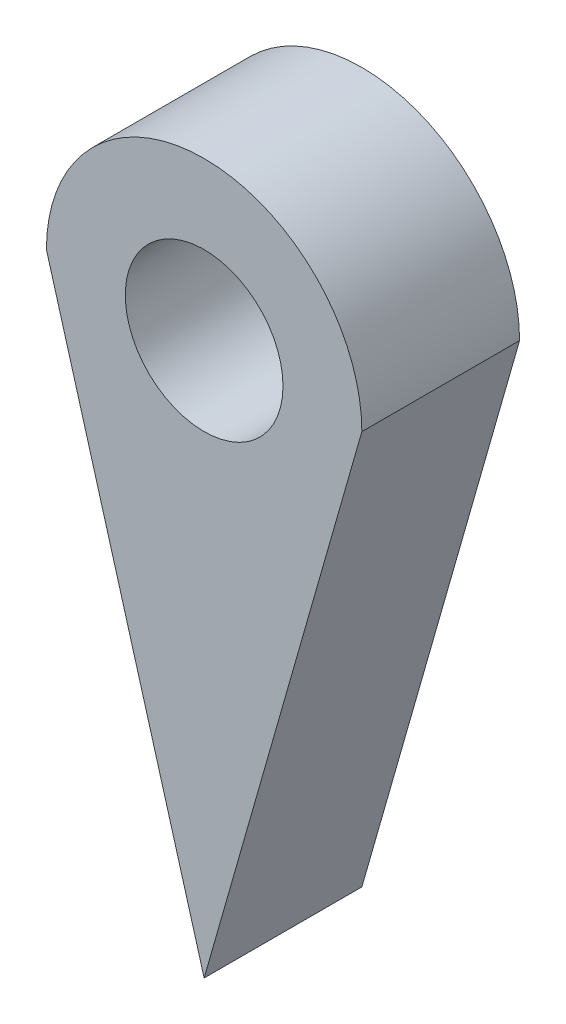
ISO-10303-21;
HEADER;
FILE_DESCRIPTION(('STEP AP214'),'2;1');
FILE_NAME('part.step','',(''),(''),'','','');
FILE_SCHEMA(('AUTOMOTIVE_DESIGN { 1 0 10303 214 1 1 1 1 }'));
ENDSEC;
DATA;
#1=APPLICATION_CONTEXT('core data for automotive mechanical design processes');
#2=APPLICATION_PROTOCOL_DEFINITION('international standard','automotive_design',2000,#1);
#3=PRODUCT_CONTEXT('',#1,'mechanical');
#4=PRODUCT('Part','Part','',(#3));
#5=PRODUCT_RELATED_PRODUCT_CATEGORY('part','',(#4));
#6=PRODUCT_DEFINITION_FORMATION('','',#4);
#7=PRODUCT_DEFINITION_CONTEXT('part definition',#1,'design');
#8=PRODUCT_DEFINITION('design','',#6,#7);
#9=PRODUCT_DEFINITION_SHAPE('','',#8);
#10=(LENGTH_UNIT() NAMED_UNIT(*) SI_UNIT(.MILLI.,.METRE.));
#11=(NAMED_UNIT(*) PLANE_ANGLE_UNIT() SI_UNIT($,.RADIAN.));
#12=(NAMED_UNIT(*) SI_UNIT($,.STERADIAN.) SOLID_ANGLE_UNIT());
#13=UNCERTAINTY_MEASURE_WITH_UNIT(LENGTH_MEASURE(1.E-05),#10,'distance_accuracy_value','');
#14=(GEOMETRIC_REPRESENTATION_CONTEXT(3) GLOBAL_UNCERTAINTY_ASSIGNED_CONTEXT((#13)) GLOBAL_UNIT_ASSIGNED_CONTEXT((#10,
#11,#12)) REPRESENTATION_CONTEXT('',''));
#15=CARTESIAN_POINT('',(0.,0.,0.));
#16=DIRECTION('',(0.,0.,1.));
#17=DIRECTION('',(1.,0.,0.));
#18=AXIS2_PLACEMENT_3D('',#15,#16,#17);
#19=CARTESIAN_POINT('',(0.,0.,4.));
#20=DIRECTION('',(0.,0.,-1.));
#21=DIRECTION('',(-1.,0.,0.));
#22=AXIS2_PLACEMENT_3D('',#19,#20,#21);
#23=CYLINDRICAL_SURFACE('',#22,4.);
#24=CARTESIAN_POINT('',(0.,0.,0.));
#25=DIRECTION('',(0.,0.,1.));
#26=DIRECTION('',(1.,0.,0.));
#27=AXIS2_PLACEMENT_3D('',#24,#25,#26);
#28=CIRCLE('',#27,4.);
#29=CARTESIAN_POINT('',(4.,0.,0.));
#30=VERTEX_POINT('',#29);
#31=CARTESIAN_POINT('',(-4.,0.,0.));
#32=VERTEX_POINT('',#31);
#33=EDGE_CURVE('E84',#30,#32,#28,.T.);
#34=ORIENTED_EDGE('',*,*,#33,.T.);
#35=DIRECTION('',(0.,0.,-1.));
#36=VECTOR('',#35,1.);
#37=CARTESIAN_POINT('',(-4.,0.,4.));
#38=LINE('',#37,#36);
#39=CARTESIAN_POINT('',(-4.,0.,4.));
#40=VERTEX_POINT('',#39);
#41=EDGE_CURVE('E11',#40,#32,#38,.T.);
#42=ORIENTED_EDGE('',*,*,#41,.F.);
#43=CARTESIAN_POINT('',(0.,0.,4.));
#44=DIRECTION('',(0.,0.,1.));
#45=DIRECTION('',(1.,0.,0.));
#46=AXIS2_PLACEMENT_3D('',#43,#44,#45);
#47=CIRCLE('',#46,4.);
#48=CARTESIAN_POINT('',(4.,0.,4.));
#49=VERTEX_POINT('',#48);
#50=EDGE_CURVE('E75',#49,#40,#47,.T.);
#51=ORIENTED_EDGE('',*,*,#50,.F.);
#52=DIRECTION('',(0.,0.,-1.));
#53=VECTOR('',#52,1.);
#54=CARTESIAN_POINT('',(4.,0.,4.));
#55=LINE('',#54,#53);
#56=EDGE_CURVE('E85',#49,#30,#55,.T.);
#57=ORIENTED_EDGE('',*,*,#56,.T.);
#58=EDGE_LOOP('',(#34,#42,#51,#57));
#59=FACE_BOUND('',#58,.T.);
#60=ADVANCED_FACE('F35',(#59),#23,.T.);
#61=CARTESIAN_POINT('',(-3.69811320754717,-1.05660377358491,4.));
#62=DIRECTION('',(0.961523947640823,0.274721127897378,0.));
#63=DIRECTION('',(-0.274721127897378,0.961523947640823,0.));
#64=AXIS2_PLACEMENT_3D('',#61,#62,#63);
#65=PLANE('',#64);
#66=DIRECTION('',(0.274721127897378,-0.961523947640823,0.));
#67=VECTOR('',#66,1.);
#68=CARTESIAN_POINT('',(-3.69811320754717,-1.05660377358491,0.));
#69=LINE('',#68,#67);
#70=CARTESIAN_POINT('',(0.,-14.,0.));
#71=VERTEX_POINT('',#70);
#72=EDGE_CURVE('E63',#32,#71,#69,.T.);
#73=ORIENTED_EDGE('',*,*,#72,.T.);
#74=DIRECTION('',(0.,0.,-1.));
#75=VECTOR('',#74,1.);
#76=CARTESIAN_POINT('',(0.,-14.,4.));
#77=LINE('',#76,#75);
#78=CARTESIAN_POINT('',(0.,-14.,4.));
#79=VERTEX_POINT('',#78);
#80=EDGE_CURVE('E43',#79,#71,#77,.T.);
#81=ORIENTED_EDGE('',*,*,#80,.F.);
#82=DIRECTION('',(0.274721127897378,-0.961523947640823,0.));
#83=VECTOR('',#82,1.);
#84=CARTESIAN_POINT('',(-3.69811320754717,-1.05660377358491,4.));
#85=LINE('',#84,#83);
#86=EDGE_CURVE('E71',#40,#79,#85,.T.);
#87=ORIENTED_EDGE('',*,*,#86,.F.);
#88=ORIENTED_EDGE('',*,*,#41,.T.);
#89=EDGE_LOOP('',(#73,#81,#87,#88));
#90=FACE_BOUND('',#89,.T.);
#91=ADVANCED_FACE('F72',(#90),#65,.F.);
#92=CARTESIAN_POINT('',(3.69811320754717,-1.05660377358491,4.));
#93=DIRECTION('',(-0.961523947640823,0.274721127897378,0.));
#94=DIRECTION('',(-0.274721127897378,-0.961523947640823,0.));
#95=AXIS2_PLACEMENT_3D('',#92,#93,#94);
#96=PLANE('',#95);
#97=DIRECTION('',(0.274721127897378,0.961523947640823,0.));
#98=VECTOR('',#97,1.);
#99=CARTESIAN_POINT('',(3.69811320754717,-1.05660377358491,0.));
#100=LINE('',#99,#98);
#101=EDGE_CURVE('E68',#71,#30,#100,.T.);
#102=ORIENTED_EDGE('',*,*,#101,.T.);
#103=ORIENTED_EDGE('',*,*,#56,.F.);
#104=DIRECTION('',(0.274721127897378,0.961523947640823,0.));
#105=VECTOR('',#104,1.);
#106=CARTESIAN_POINT('',(3.69811320754717,-1.05660377358491,4.));
#107=LINE('',#106,#105);
#108=EDGE_CURVE('E51',#79,#49,#107,.T.);
#109=ORIENTED_EDGE('',*,*,#108,.F.);
#110=ORIENTED_EDGE('',*,*,#80,.T.);
#111=EDGE_LOOP('',(#102,#103,#109,#110));
#112=FACE_BOUND('',#111,.T.);
#113=ADVANCED_FACE('F96',(#112),#96,.F.);
#114=CARTESIAN_POINT('',(0.,0.,4.));
#115=DIRECTION('',(0.,0.,-1.));
#116=DIRECTION('',(-1.,0.,0.));
#117=AXIS2_PLACEMENT_3D('',#114,#115,#116);
#118=CYLINDRICAL_SURFACE('',#117,2.);
#119=CARTESIAN_POINT('',(0.,0.,4.));
#120=DIRECTION('',(0.,0.,1.));
#121=DIRECTION('',(1.,0.,0.));
#122=AXIS2_PLACEMENT_3D('',#119,#120,#121);
#123=CIRCLE('',#122,2.);
#124=CARTESIAN_POINT('',(2.,0.,4.));
#125=VERTEX_POINT('',#124);
#126=EDGE_CURVE('E90',#125,#125,#123,.T.);
#127=ORIENTED_EDGE('',*,*,#126,.T.);
#128=EDGE_LOOP('',(#127));
#129=FACE_BOUND('',#128,.T.);
#130=CARTESIAN_POINT('',(0.,0.,0.));
#131=DIRECTION('',(0.,0.,1.));
#132=DIRECTION('',(1.,0.,0.));
#133=AXIS2_PLACEMENT_3D('',#130,#131,#132);
#134=CIRCLE('',#133,2.);
#135=CARTESIAN_POINT('',(2.,0.,0.));
#136=VERTEX_POINT('',#135);
#137=EDGE_CURVE('E81',#136,#136,#134,.T.);
#138=ORIENTED_EDGE('',*,*,#137,.F.);
#139=EDGE_LOOP('',(#138));
#140=FACE_BOUND('',#139,.T.);
#141=ADVANCED_FACE('F103',(#129,#140),#118,.F.);
#142=CARTESIAN_POINT('',(0.,0.,4.));
#143=DIRECTION('',(0.,0.,1.));
#144=DIRECTION('',(1.,0.,0.));
#145=AXIS2_PLACEMENT_3D('',#142,#143,#144);
#146=PLANE('',#145);
#147=ORIENTED_EDGE('',*,*,#50,.T.);
#148=ORIENTED_EDGE('',*,*,#86,.T.);
#149=ORIENTED_EDGE('',*,*,#108,.T.);
#150=EDGE_LOOP('',(#147,#148,#149));
#151=FACE_BOUND('',#150,.T.);
#152=ORIENTED_EDGE('',*,*,#126,.F.);
#153=EDGE_LOOP('',(#152));
#154=FACE_BOUND('',#153,.T.);
#155=ADVANCED_FACE('F78',(#151,#154),#146,.T.);
#156=CARTESIAN_POINT('',(0.,0.,0.));
#157=DIRECTION('',(0.,0.,1.));
#158=DIRECTION('',(1.,0.,0.));
#159=AXIS2_PLACEMENT_3D('',#156,#157,#158);
#160=PLANE('',#159);
#161=ORIENTED_EDGE('',*,*,#33,.F.);
#162=ORIENTED_EDGE('',*,*,#101,.F.);
#163=ORIENTED_EDGE('',*,*,#72,.F.);
#164=EDGE_LOOP('',(#161,#162,#163));
#165=FACE_BOUND('',#164,.T.);
#166=ORIENTED_EDGE('',*,*,#137,.T.);
#167=EDGE_LOOP('',(#166));
#168=FACE_BOUND('',#167,.T.);
#169=ADVANCED_FACE('F97',(#165,#168),#160,.F.);
#170=CLOSED_SHELL('',(#60,#91,#113,#141,#155,#169));
#171=MANIFOLD_SOLID_BREP('B2',#170);
#172=ADVANCED_BREP_SHAPE_REPRESENTATION('',(#18,#171),#14);
#173=SHAPE_DEFINITION_REPRESENTATION(#9,#172);
ENDSEC;
END-ISO-10303-21;
